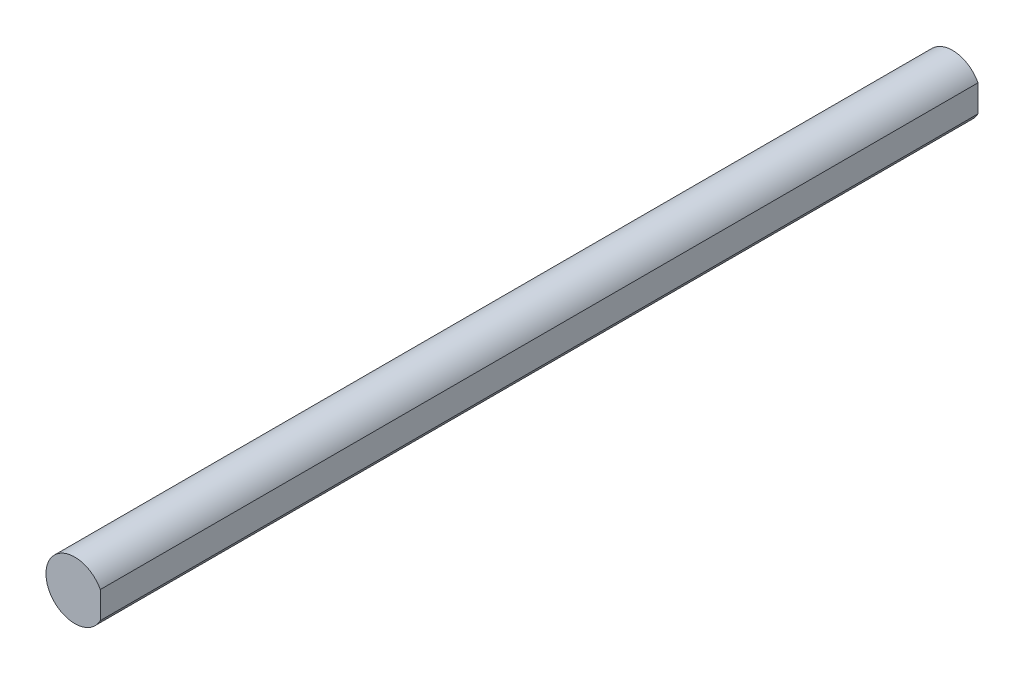
ISO-10303-21;
HEADER;
FILE_DESCRIPTION(('STEP AP214'),'2;1');
FILE_NAME('part.step','',(''),(''),'','','');
FILE_SCHEMA(('AUTOMOTIVE_DESIGN { 1 0 10303 214 1 1 1 1 }'));
ENDSEC;
DATA;
#1=APPLICATION_CONTEXT('core data for automotive mechanical design processes');
#2=APPLICATION_PROTOCOL_DEFINITION('international standard','automotive_design',2000,#1);
#3=PRODUCT_CONTEXT('',#1,'mechanical');
#4=PRODUCT('Part','Part','',(#3));
#5=PRODUCT_RELATED_PRODUCT_CATEGORY('part','',(#4));
#6=PRODUCT_DEFINITION_FORMATION('','',#4);
#7=PRODUCT_DEFINITION_CONTEXT('part definition',#1,'design');
#8=PRODUCT_DEFINITION('design','',#6,#7);
#9=PRODUCT_DEFINITION_SHAPE('','',#8);
#10=(LENGTH_UNIT() NAMED_UNIT(*) SI_UNIT(.MILLI.,.METRE.));
#11=(NAMED_UNIT(*) PLANE_ANGLE_UNIT() SI_UNIT($,.RADIAN.));
#12=(NAMED_UNIT(*) SI_UNIT($,.STERADIAN.) SOLID_ANGLE_UNIT());
#13=UNCERTAINTY_MEASURE_WITH_UNIT(LENGTH_MEASURE(1.E-05),#10,'distance_accuracy_value','');
#14=(GEOMETRIC_REPRESENTATION_CONTEXT(3) GLOBAL_UNCERTAINTY_ASSIGNED_CONTEXT((#13)) GLOBAL_UNIT_ASSIGNED_CONTEXT((#10,
#11,#12)) REPRESENTATION_CONTEXT('',''));
#15=CARTESIAN_POINT('',(0.,0.,0.));
#16=DIRECTION('',(0.,0.,1.));
#17=DIRECTION('',(1.,0.,0.));
#18=AXIS2_PLACEMENT_3D('',#15,#16,#17);
#19=CARTESIAN_POINT('',(2.5843274223305,0.,88.9));
#20=DIRECTION('',(-1.,0.,0.));
#21=DIRECTION('',(0.,0.,1.));
#22=AXIS2_PLACEMENT_3D('',#19,#20,#21);
#23=PLANE('',#22);
#24=DIRECTION('',(0.,1.,0.));
#25=VECTOR('',#24,1.);
#26=CARTESIAN_POINT('',(2.5843274223305,0.,0.));
#27=LINE('',#26,#25);
#28=CARTESIAN_POINT('',(2.5843274223305,-1.36143041474421,0.));
#29=VERTEX_POINT('',#28);
#30=CARTESIAN_POINT('',(2.5843274223305,1.36143041474421,0.));
#31=VERTEX_POINT('',#30);
#32=EDGE_CURVE('E66',#29,#31,#27,.T.);
#33=ORIENTED_EDGE('',*,*,#32,.T.);
#34=DIRECTION('',(0.,0.,-1.));
#35=VECTOR('',#34,1.);
#36=CARTESIAN_POINT('',(2.5843274223305,1.36143041474421,88.9));
#37=LINE('',#36,#35);
#38=CARTESIAN_POINT('',(2.5843274223305,1.36143041474421,88.9));
#39=VERTEX_POINT('',#38);
#40=EDGE_CURVE('E11',#39,#31,#37,.T.);
#41=ORIENTED_EDGE('',*,*,#40,.F.);
#42=DIRECTION('',(0.,1.,0.));
#43=VECTOR('',#42,1.);
#44=CARTESIAN_POINT('',(2.5843274223305,0.,88.9));
#45=LINE('',#44,#43);
#46=CARTESIAN_POINT('',(2.5843274223305,-1.36143041474421,88.9));
#47=VERTEX_POINT('',#46);
#48=EDGE_CURVE('E65',#47,#39,#45,.T.);
#49=ORIENTED_EDGE('',*,*,#48,.F.);
#50=DIRECTION('',(0.,0.,-1.));
#51=VECTOR('',#50,1.);
#52=CARTESIAN_POINT('',(2.5843274223305,-1.36143041474421,88.9));
#53=LINE('',#52,#51);
#54=EDGE_CURVE('E43',#47,#29,#53,.T.);
#55=ORIENTED_EDGE('',*,*,#54,.T.);
#56=EDGE_LOOP('',(#33,#41,#49,#55));
#57=FACE_BOUND('',#56,.T.);
#58=ADVANCED_FACE('F35',(#57),#23,.F.);
#59=CARTESIAN_POINT('',(0.,0.,88.9));
#60=DIRECTION('',(0.,0.,-1.));
#61=DIRECTION('',(-1.,0.,0.));
#62=AXIS2_PLACEMENT_3D('',#59,#60,#61);
#63=CYLINDRICAL_SURFACE('',#62,2.921);
#64=CARTESIAN_POINT('',(0.,0.,0.));
#65=DIRECTION('',(0.,0.,1.));
#66=DIRECTION('',(1.,0.,0.));
#67=AXIS2_PLACEMENT_3D('',#64,#65,#66);
#68=CIRCLE('',#67,2.921);
#69=EDGE_CURVE('E58',#31,#29,#68,.T.);
#70=ORIENTED_EDGE('',*,*,#69,.T.);
#71=ORIENTED_EDGE('',*,*,#54,.F.);
#72=CARTESIAN_POINT('',(0.,0.,88.9));
#73=DIRECTION('',(0.,0.,1.));
#74=DIRECTION('',(1.,0.,0.));
#75=AXIS2_PLACEMENT_3D('',#72,#73,#74);
#76=CIRCLE('',#75,2.921);
#77=EDGE_CURVE('E50',#39,#47,#76,.T.);
#78=ORIENTED_EDGE('',*,*,#77,.F.);
#79=ORIENTED_EDGE('',*,*,#40,.T.);
#80=EDGE_LOOP('',(#70,#71,#78,#79));
#81=FACE_BOUND('',#80,.T.);
#82=ADVANCED_FACE('F61',(#81),#63,.T.);
#83=CARTESIAN_POINT('',(0.,0.,88.9));
#84=DIRECTION('',(0.,0.,1.));
#85=DIRECTION('',(1.,0.,0.));
#86=AXIS2_PLACEMENT_3D('',#83,#84,#85);
#87=PLANE('',#86);
#88=ORIENTED_EDGE('',*,*,#48,.T.);
#89=ORIENTED_EDGE('',*,*,#77,.T.);
#90=EDGE_LOOP('',(#88,#89));
#91=FACE_BOUND('',#90,.T.);
#92=ADVANCED_FACE('F73',(#91),#87,.T.);
#93=CARTESIAN_POINT('',(0.,0.,0.));
#94=DIRECTION('',(0.,0.,1.));
#95=DIRECTION('',(1.,0.,0.));
#96=AXIS2_PLACEMENT_3D('',#93,#94,#95);
#97=PLANE('',#96);
#98=ORIENTED_EDGE('',*,*,#32,.F.);
#99=ORIENTED_EDGE('',*,*,#69,.F.);
#100=EDGE_LOOP('',(#98,#99));
#101=FACE_BOUND('',#100,.T.);
#102=ADVANCED_FACE('F69',(#101),#97,.F.);
#103=CLOSED_SHELL('',(#58,#82,#92,#102));
#104=MANIFOLD_SOLID_BREP('B2',#103);
#105=ADVANCED_BREP_SHAPE_REPRESENTATION('',(#18,#104),#14);
#106=SHAPE_DEFINITION_REPRESENTATION(#9,#105);
ENDSEC;
END-ISO-10303-21;
